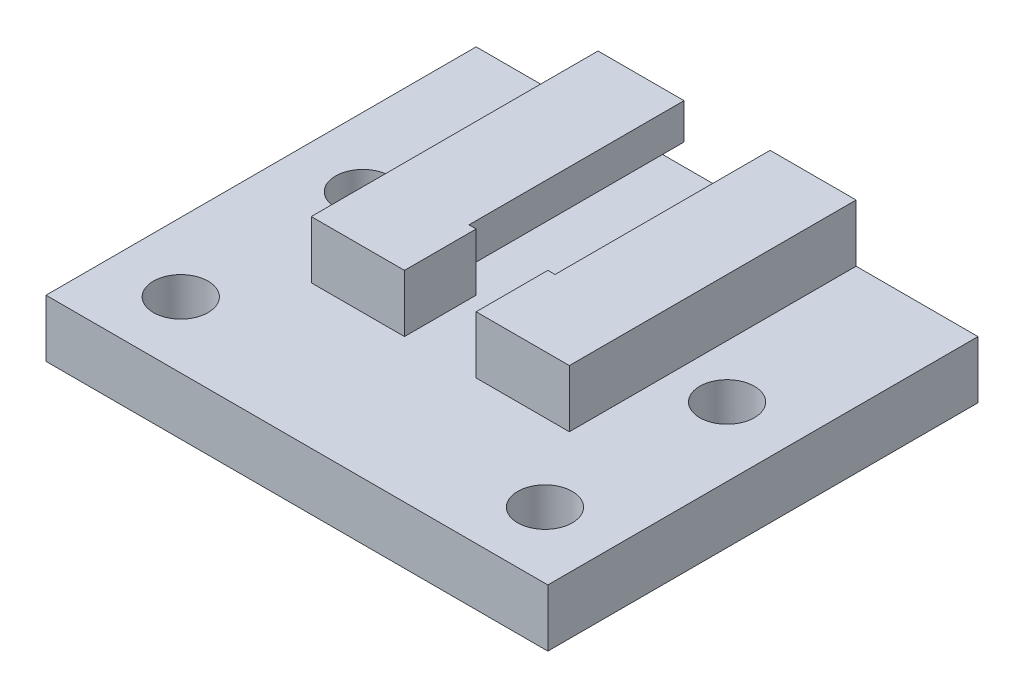
ISO-10303-21;
HEADER;
FILE_DESCRIPTION(('STEP AP214'),'2;1');
FILE_NAME('part.step','',(''),(''),'','','');
FILE_SCHEMA(('AUTOMOTIVE_DESIGN { 1 0 10303 214 1 1 1 1 }'));
ENDSEC;
DATA;
#1=APPLICATION_CONTEXT('core data for automotive mechanical design processes');
#2=APPLICATION_PROTOCOL_DEFINITION('international standard','automotive_design',2000,#1);
#3=PRODUCT_CONTEXT('',#1,'mechanical');
#4=PRODUCT('Part','Part','',(#3));
#5=PRODUCT_RELATED_PRODUCT_CATEGORY('part','',(#4));
#6=PRODUCT_DEFINITION_FORMATION('','',#4);
#7=PRODUCT_DEFINITION_CONTEXT('part definition',#1,'design');
#8=PRODUCT_DEFINITION('design','',#6,#7);
#9=PRODUCT_DEFINITION_SHAPE('','',#8);
#10=(LENGTH_UNIT() NAMED_UNIT(*) SI_UNIT(.MILLI.,.METRE.));
#11=(NAMED_UNIT(*) PLANE_ANGLE_UNIT() SI_UNIT($,.RADIAN.));
#12=(NAMED_UNIT(*) SI_UNIT($,.STERADIAN.) SOLID_ANGLE_UNIT());
#13=UNCERTAINTY_MEASURE_WITH_UNIT(LENGTH_MEASURE(1.E-05),#10,'distance_accuracy_value','');
#14=(GEOMETRIC_REPRESENTATION_CONTEXT(3) GLOBAL_UNCERTAINTY_ASSIGNED_CONTEXT((#13)) GLOBAL_UNIT_ASSIGNED_CONTEXT((#10,
#11,#12)) REPRESENTATION_CONTEXT('',''));
#15=CARTESIAN_POINT('',(0.,0.,0.));
#16=DIRECTION('',(0.,0.,1.));
#17=DIRECTION('',(1.,0.,0.));
#18=AXIS2_PLACEMENT_3D('',#15,#16,#17);
#19=CARTESIAN_POINT('',(0.,0.,5.));
#20=DIRECTION('',(0.,0.,1.));
#21=DIRECTION('',(1.,0.,0.));
#22=AXIS2_PLACEMENT_3D('',#19,#20,#21);
#23=PLANE('',#22);
#24=DIRECTION('',(-1.,0.,0.));
#25=VECTOR('',#24,1.);
#26=CARTESIAN_POINT('',(0.,4.,5.));
#27=LINE('',#26,#25);
#28=CARTESIAN_POINT('',(18.,4.,5.));
#29=VERTEX_POINT('',#28);
#30=CARTESIAN_POINT('',(11.5,4.,5.));
#31=VERTEX_POINT('',#30);
#32=EDGE_CURVE('E251',#29,#31,#27,.T.);
#33=ORIENTED_EDGE('',*,*,#32,.F.);
#34=DIRECTION('',(0.,1.,0.));
#35=VECTOR('',#34,1.);
#36=CARTESIAN_POINT('',(18.,0.,5.));
#37=LINE('',#36,#35);
#38=CARTESIAN_POINT('',(18.,8.,5.));
#39=VERTEX_POINT('',#38);
#40=EDGE_CURVE('E290',#29,#39,#37,.T.);
#41=ORIENTED_EDGE('',*,*,#40,.T.);
#42=DIRECTION('',(-1.,0.,0.));
#43=VECTOR('',#42,1.);
#44=CARTESIAN_POINT('',(0.,8.,5.));
#45=LINE('',#44,#43);
#46=CARTESIAN_POINT('',(11.5,8.,5.));
#47=VERTEX_POINT('',#46);
#48=EDGE_CURVE('E293',#39,#47,#45,.T.);
#49=ORIENTED_EDGE('',*,*,#48,.T.);
#50=DIRECTION('',(0.,-1.,0.));
#51=VECTOR('',#50,1.);
#52=CARTESIAN_POINT('',(11.5,0.,5.));
#53=LINE('',#52,#51);
#54=EDGE_CURVE('E273',#47,#31,#53,.T.);
#55=ORIENTED_EDGE('',*,*,#54,.T.);
#56=EDGE_LOOP('',(#33,#41,#49,#55));
#57=FACE_BOUND('',#56,.T.);
#58=ADVANCED_FACE('F45',(#57),#23,.T.);
#59=CARTESIAN_POINT('',(0.,8.,-15.));
#60=DIRECTION('',(0.,0.,1.));
#61=DIRECTION('',(1.,0.,0.));
#62=AXIS2_PLACEMENT_3D('',#59,#60,#61);
#63=PLANE('',#62);
#64=DIRECTION('',(0.,-1.,0.));
#65=VECTOR('',#64,1.);
#66=CARTESIAN_POINT('',(4.,0.,-15.));
#67=LINE('',#66,#65);
#68=CARTESIAN_POINT('',(4.,5.5,-15.));
#69=VERTEX_POINT('',#68);
#70=CARTESIAN_POINT('',(4.,4.,-15.));
#71=VERTEX_POINT('',#70);
#72=EDGE_CURVE('E324',#69,#71,#67,.T.);
#73=ORIENTED_EDGE('',*,*,#72,.T.);
#74=DIRECTION('',(1.,0.,0.));
#75=VECTOR('',#74,1.);
#76=CARTESIAN_POINT('',(-8.5,4.,-15.));
#77=LINE('',#76,#75);
#78=CARTESIAN_POINT('',(14.,4.,-15.));
#79=VERTEX_POINT('',#78);
#80=EDGE_CURVE('E211',#71,#79,#77,.T.);
#81=ORIENTED_EDGE('',*,*,#80,.T.);
#82=DIRECTION('',(0.,-1.,0.));
#83=VECTOR('',#82,1.);
#84=CARTESIAN_POINT('',(14.,0.,-15.));
#85=LINE('',#84,#83);
#86=CARTESIAN_POINT('',(14.,5.5,-15.));
#87=VERTEX_POINT('',#86);
#88=EDGE_CURVE('E328',#87,#79,#85,.T.);
#89=ORIENTED_EDGE('',*,*,#88,.F.);
#90=DIRECTION('',(1.,0.,0.));
#91=VECTOR('',#90,1.);
#92=CARTESIAN_POINT('',(0.,5.5,-15.));
#93=LINE('',#92,#91);
#94=CARTESIAN_POINT('',(12.,5.5,-15.));
#95=VERTEX_POINT('',#94);
#96=EDGE_CURVE('E325',#95,#87,#93,.T.);
#97=ORIENTED_EDGE('',*,*,#96,.F.);
#98=DIRECTION('',(0.,-1.,0.));
#99=VECTOR('',#98,1.);
#100=CARTESIAN_POINT('',(12.,0.,-15.));
#101=LINE('',#100,#99);
#102=CARTESIAN_POINT('',(12.,8.,-15.));
#103=VERTEX_POINT('',#102);
#104=EDGE_CURVE('E316',#103,#95,#101,.T.);
#105=ORIENTED_EDGE('',*,*,#104,.F.);
#106=DIRECTION('',(-1.,0.,0.));
#107=VECTOR('',#106,1.);
#108=CARTESIAN_POINT('',(0.,8.,-15.));
#109=LINE('',#108,#107);
#110=CARTESIAN_POINT('',(18.,8.,-15.));
#111=VERTEX_POINT('',#110);
#112=EDGE_CURVE('E382',#111,#103,#109,.T.);
#113=ORIENTED_EDGE('',*,*,#112,.F.);
#114=DIRECTION('',(0.,-1.,0.));
#115=VECTOR('',#114,1.);
#116=CARTESIAN_POINT('',(18.,8.,-15.));
#117=LINE('',#116,#115);
#118=CARTESIAN_POINT('',(18.,4.,-15.));
#119=VERTEX_POINT('',#118);
#120=EDGE_CURVE('E55',#111,#119,#117,.T.);
#121=ORIENTED_EDGE('',*,*,#120,.T.);
#122=CARTESIAN_POINT('',(26.5,4.,-15.));
#123=VERTEX_POINT('',#122);
#124=EDGE_CURVE('E213',#119,#123,#77,.T.);
#125=ORIENTED_EDGE('',*,*,#124,.T.);
#126=DIRECTION('',(0.,-1.,0.));
#127=VECTOR('',#126,1.);
#128=CARTESIAN_POINT('',(26.5,4.,-15.));
#129=LINE('',#128,#127);
#130=CARTESIAN_POINT('',(26.5,0.,-15.));
#131=VERTEX_POINT('',#130);
#132=EDGE_CURVE('E199',#123,#131,#129,.T.);
#133=ORIENTED_EDGE('',*,*,#132,.T.);
#134=DIRECTION('',(-1.,0.,0.));
#135=VECTOR('',#134,1.);
#136=CARTESIAN_POINT('',(0.,0.,-15.));
#137=LINE('',#136,#135);
#138=CARTESIAN_POINT('',(-8.5,0.,-15.));
#139=VERTEX_POINT('',#138);
#140=EDGE_CURVE('E193',#131,#139,#137,.T.);
#141=ORIENTED_EDGE('',*,*,#140,.T.);
#142=DIRECTION('',(0.,-1.,0.));
#143=VECTOR('',#142,1.);
#144=CARTESIAN_POINT('',(-8.5,4.,-15.));
#145=LINE('',#144,#143);
#146=CARTESIAN_POINT('',(-8.5,4.,-15.));
#147=VERTEX_POINT('',#146);
#148=EDGE_CURVE('E185',#147,#139,#145,.T.);
#149=ORIENTED_EDGE('',*,*,#148,.F.);
#150=CARTESIAN_POINT('',(0.,4.,-15.));
#151=VERTEX_POINT('',#150);
#152=EDGE_CURVE('E190',#147,#151,#77,.T.);
#153=ORIENTED_EDGE('',*,*,#152,.T.);
#154=DIRECTION('',(0.,-1.,0.));
#155=VECTOR('',#154,1.);
#156=CARTESIAN_POINT('',(0.,8.,-15.));
#157=LINE('',#156,#155);
#158=CARTESIAN_POINT('',(0.,8.,-15.));
#159=VERTEX_POINT('',#158);
#160=EDGE_CURVE('E386',#159,#151,#157,.T.);
#161=ORIENTED_EDGE('',*,*,#160,.F.);
#162=CARTESIAN_POINT('',(6.,8.,-15.));
#163=VERTEX_POINT('',#162);
#164=EDGE_CURVE('E381',#163,#159,#109,.T.);
#165=ORIENTED_EDGE('',*,*,#164,.F.);
#166=DIRECTION('',(0.,-1.,0.));
#167=VECTOR('',#166,1.);
#168=CARTESIAN_POINT('',(6.,0.,-15.));
#169=LINE('',#168,#167);
#170=CARTESIAN_POINT('',(6.,5.5,-15.));
#171=VERTEX_POINT('',#170);
#172=EDGE_CURVE('E70',#163,#171,#169,.T.);
#173=ORIENTED_EDGE('',*,*,#172,.T.);
#174=EDGE_CURVE('E321',#69,#171,#93,.T.);
#175=ORIENTED_EDGE('',*,*,#174,.F.);
#176=EDGE_LOOP('',(#73,#81,#89,#97,#105,#113,#121,#125,#133,#141,#149,#153,#161,#165,#173,#175));
#177=FACE_BOUND('',#176,.T.);
#178=ADVANCED_FACE('F188',(#177),#63,.F.);
#179=CARTESIAN_POINT('',(0.,8.,0.));
#180=DIRECTION('',(0.,-1.,0.));
#181=DIRECTION('',(0.,0.,-1.));
#182=AXIS2_PLACEMENT_3D('',#179,#180,#181);
#183=PLANE('',#182);
#184=DIRECTION('',(0.,0.,1.));
#185=VECTOR('',#184,1.);
#186=CARTESIAN_POINT('',(12.,8.,-15.));
#187=LINE('',#186,#185);
#188=CARTESIAN_POINT('',(12.,8.,0.));
#189=VERTEX_POINT('',#188);
#190=EDGE_CURVE('E352',#103,#189,#187,.T.);
#191=ORIENTED_EDGE('',*,*,#190,.T.);
#192=DIRECTION('',(-1.,0.,0.));
#193=VECTOR('',#192,1.);
#194=CARTESIAN_POINT('',(0.,8.,0.));
#195=LINE('',#194,#193);
#196=CARTESIAN_POINT('',(11.5,8.,0.));
#197=VERTEX_POINT('',#196);
#198=EDGE_CURVE('E278',#189,#197,#195,.T.);
#199=ORIENTED_EDGE('',*,*,#198,.T.);
#200=DIRECTION('',(0.,0.,-1.));
#201=VECTOR('',#200,1.);
#202=CARTESIAN_POINT('',(11.5,8.,5.));
#203=LINE('',#202,#201);
#204=EDGE_CURVE('E296',#47,#197,#203,.T.);
#205=ORIENTED_EDGE('',*,*,#204,.F.);
#206=ORIENTED_EDGE('',*,*,#48,.F.);
#207=DIRECTION('',(0.,0.,-1.));
#208=VECTOR('',#207,1.);
#209=CARTESIAN_POINT('',(18.,8.,0.));
#210=LINE('',#209,#208);
#211=EDGE_CURVE('E378',#39,#111,#210,.T.);
#212=ORIENTED_EDGE('',*,*,#211,.T.);
#213=ORIENTED_EDGE('',*,*,#112,.T.);
#214=EDGE_LOOP('',(#191,#199,#205,#206,#212,#213));
#215=FACE_BOUND('',#214,.T.);
#216=ADVANCED_FACE('F473',(#215),#183,.F.);
#217=CARTESIAN_POINT('',(0.,8.,0.));
#218=DIRECTION('',(1.,0.,0.));
#219=DIRECTION('',(0.,0.,-1.));
#220=AXIS2_PLACEMENT_3D('',#217,#218,#219);
#221=PLANE('',#220);
#222=ORIENTED_EDGE('',*,*,#160,.T.);
#223=DIRECTION('',(0.,0.,1.));
#224=VECTOR('',#223,1.);
#225=CARTESIAN_POINT('',(0.,4.,0.));
#226=LINE('',#225,#224);
#227=CARTESIAN_POINT('',(0.,4.,5.));
#228=VERTEX_POINT('',#227);
#229=EDGE_CURVE('E208',#151,#228,#226,.T.);
#230=ORIENTED_EDGE('',*,*,#229,.T.);
#231=DIRECTION('',(0.,-1.,0.));
#232=VECTOR('',#231,1.);
#233=CARTESIAN_POINT('',(0.,0.,5.));
#234=LINE('',#233,#232);
#235=CARTESIAN_POINT('',(0.,8.,5.));
#236=VERTEX_POINT('',#235);
#237=EDGE_CURVE('E286',#236,#228,#234,.T.);
#238=ORIENTED_EDGE('',*,*,#237,.F.);
#239=DIRECTION('',(0.,0.,1.));
#240=VECTOR('',#239,1.);
#241=CARTESIAN_POINT('',(0.,8.,0.));
#242=LINE('',#241,#240);
#243=EDGE_CURVE('E375',#159,#236,#242,.T.);
#244=ORIENTED_EDGE('',*,*,#243,.F.);
#245=EDGE_LOOP('',(#222,#230,#238,#244));
#246=FACE_BOUND('',#245,.T.);
#247=ADVANCED_FACE('F47',(#246),#221,.F.);
#248=CARTESIAN_POINT('',(18.,8.,0.));
#249=DIRECTION('',(-1.,0.,0.));
#250=DIRECTION('',(0.,0.,1.));
#251=AXIS2_PLACEMENT_3D('',#248,#249,#250);
#252=PLANE('',#251);
#253=ORIENTED_EDGE('',*,*,#40,.F.);
#254=DIRECTION('',(0.,0.,-1.));
#255=VECTOR('',#254,1.);
#256=CARTESIAN_POINT('',(18.,4.,0.));
#257=LINE('',#256,#255);
#258=EDGE_CURVE('E254',#29,#119,#257,.T.);
#259=ORIENTED_EDGE('',*,*,#258,.T.);
#260=ORIENTED_EDGE('',*,*,#120,.F.);
#261=ORIENTED_EDGE('',*,*,#211,.F.);
#262=EDGE_LOOP('',(#253,#259,#260,#261));
#263=FACE_BOUND('',#262,.T.);
#264=ADVANCED_FACE('F467',(#263),#252,.F.);
#265=ORIENTED_EDGE('',*,*,#243,.T.);
#266=DIRECTION('',(-1.,0.,0.));
#267=VECTOR('',#266,1.);
#268=CARTESIAN_POINT('',(0.,8.,5.));
#269=LINE('',#268,#267);
#270=CARTESIAN_POINT('',(6.5,8.,5.));
#271=VERTEX_POINT('',#270);
#272=EDGE_CURVE('E282',#271,#236,#269,.T.);
#273=ORIENTED_EDGE('',*,*,#272,.F.);
#274=DIRECTION('',(0.,0.,-1.));
#275=VECTOR('',#274,1.);
#276=CARTESIAN_POINT('',(6.5,8.,5.));
#277=LINE('',#276,#275);
#278=CARTESIAN_POINT('',(6.5,8.,0.));
#279=VERTEX_POINT('',#278);
#280=EDGE_CURVE('E313',#271,#279,#277,.T.);
#281=ORIENTED_EDGE('',*,*,#280,.T.);
#282=DIRECTION('',(-1.,0.,0.));
#283=VECTOR('',#282,1.);
#284=CARTESIAN_POINT('',(0.,8.,0.));
#285=LINE('',#284,#283);
#286=CARTESIAN_POINT('',(6.,8.,0.));
#287=VERTEX_POINT('',#286);
#288=EDGE_CURVE('E304',#279,#287,#285,.T.);
#289=ORIENTED_EDGE('',*,*,#288,.T.);
#290=DIRECTION('',(0.,0.,1.));
#291=VECTOR('',#290,1.);
#292=CARTESIAN_POINT('',(6.,8.,-15.));
#293=LINE('',#292,#291);
#294=EDGE_CURVE('E349',#163,#287,#293,.T.);
#295=ORIENTED_EDGE('',*,*,#294,.F.);
#296=ORIENTED_EDGE('',*,*,#164,.T.);
#297=EDGE_LOOP('',(#265,#273,#281,#289,#295,#296));
#298=FACE_BOUND('',#297,.T.);
#299=ADVANCED_FACE('F451',(#298),#183,.F.);
#300=CARTESIAN_POINT('',(0.,0.,0.));
#301=DIRECTION('',(0.,-1.,0.));
#302=DIRECTION('',(0.,0.,-1.));
#303=AXIS2_PLACEMENT_3D('',#300,#301,#302);
#304=PLANE('',#303);
#305=CARTESIAN_POINT('',(21.7,0.,-2.29999999999999));
#306=DIRECTION('',(0.,-1.,0.));
#307=DIRECTION('',(0.,0.,-1.));
#308=AXIS2_PLACEMENT_3D('',#305,#306,#307);
#309=CIRCLE('',#308,1.905);
#310=CARTESIAN_POINT('',(21.7,0.,-4.20499999999999));
#311=VERTEX_POINT('',#310);
#312=EDGE_CURVE('E441',#311,#311,#309,.T.);
#313=ORIENTED_EDGE('',*,*,#312,.F.);
#314=EDGE_LOOP('',(#313));
#315=FACE_BOUND('',#314,.T.);
#316=CARTESIAN_POINT('',(-3.7,0.,10.4));
#317=DIRECTION('',(0.,-1.,0.));
#318=DIRECTION('',(0.,0.,-1.));
#319=AXIS2_PLACEMENT_3D('',#316,#317,#318);
#320=CIRCLE('',#319,1.905);
#321=CARTESIAN_POINT('',(-3.7,0.,8.49500000000001));
#322=VERTEX_POINT('',#321);
#323=EDGE_CURVE('E435',#322,#322,#320,.T.);
#324=ORIENTED_EDGE('',*,*,#323,.F.);
#325=EDGE_LOOP('',(#324));
#326=FACE_BOUND('',#325,.T.);
#327=CARTESIAN_POINT('',(21.7,0.,10.4));
#328=DIRECTION('',(0.,-1.,0.));
#329=DIRECTION('',(0.,0.,-1.));
#330=AXIS2_PLACEMENT_3D('',#327,#328,#329);
#331=CIRCLE('',#330,1.905);
#332=CARTESIAN_POINT('',(21.7,0.,8.49500000000001));
#333=VERTEX_POINT('',#332);
#334=EDGE_CURVE('E432',#333,#333,#331,.T.);
#335=ORIENTED_EDGE('',*,*,#334,.F.);
#336=EDGE_LOOP('',(#335));
#337=FACE_BOUND('',#336,.T.);
#338=CARTESIAN_POINT('',(-3.7,0.,-2.29999999999999));
#339=DIRECTION('',(0.,-1.,0.));
#340=DIRECTION('',(0.,0.,-1.));
#341=AXIS2_PLACEMENT_3D('',#338,#339,#340);
#342=CIRCLE('',#341,1.905);
#343=CARTESIAN_POINT('',(-3.7,0.,-4.20499999999999));
#344=VERTEX_POINT('',#343);
#345=EDGE_CURVE('E225',#344,#344,#342,.T.);
#346=ORIENTED_EDGE('',*,*,#345,.F.);
#347=EDGE_LOOP('',(#346));
#348=FACE_BOUND('',#347,.T.);
#349=ORIENTED_EDGE('',*,*,#140,.F.);
#350=DIRECTION('',(0.,0.,1.));
#351=VECTOR('',#350,1.);
#352=CARTESIAN_POINT('',(26.5,0.,-15.));
#353=LINE('',#352,#351);
#354=CARTESIAN_POINT('',(26.5,0.,15.));
#355=VERTEX_POINT('',#354);
#356=EDGE_CURVE('E222',#131,#355,#353,.T.);
#357=ORIENTED_EDGE('',*,*,#356,.T.);
#358=DIRECTION('',(-1.,0.,0.));
#359=VECTOR('',#358,1.);
#360=CARTESIAN_POINT('',(-8.5,0.,15.));
#361=LINE('',#360,#359);
#362=CARTESIAN_POINT('',(-8.5,0.,15.));
#363=VERTEX_POINT('',#362);
#364=EDGE_CURVE('E217',#355,#363,#361,.T.);
#365=ORIENTED_EDGE('',*,*,#364,.T.);
#366=DIRECTION('',(0.,0.,-1.));
#367=VECTOR('',#366,1.);
#368=CARTESIAN_POINT('',(-8.5,0.,-15.));
#369=LINE('',#368,#367);
#370=EDGE_CURVE('E233',#363,#139,#369,.T.);
#371=ORIENTED_EDGE('',*,*,#370,.T.);
#372=EDGE_LOOP('',(#349,#357,#365,#371));
#373=FACE_BOUND('',#372,.T.);
#374=ADVANCED_FACE('F447',(#315,#326,#337,#348,#373),#304,.T.);
#375=CARTESIAN_POINT('',(0.,5.5,-15.));
#376=DIRECTION('',(0.,-1.,0.));
#377=DIRECTION('',(0.,0.,-1.));
#378=AXIS2_PLACEMENT_3D('',#375,#376,#377);
#379=PLANE('',#378);
#380=DIRECTION('',(-1.,0.,0.));
#381=VECTOR('',#380,1.);
#382=CARTESIAN_POINT('',(0.,5.5,0.));
#383=LINE('',#382,#381);
#384=CARTESIAN_POINT('',(14.,5.5,0.));
#385=VERTEX_POINT('',#384);
#386=CARTESIAN_POINT('',(12.,5.5,0.));
#387=VERTEX_POINT('',#386);
#388=EDGE_CURVE('E372',#385,#387,#383,.T.);
#389=ORIENTED_EDGE('',*,*,#388,.T.);
#390=DIRECTION('',(0.,0.,1.));
#391=VECTOR('',#390,1.);
#392=CARTESIAN_POINT('',(12.,5.5,-15.));
#393=LINE('',#392,#391);
#394=EDGE_CURVE('E332',#95,#387,#393,.T.);
#395=ORIENTED_EDGE('',*,*,#394,.F.);
#396=ORIENTED_EDGE('',*,*,#96,.T.);
#397=DIRECTION('',(0.,0.,1.));
#398=VECTOR('',#397,1.);
#399=CARTESIAN_POINT('',(14.,5.5,-15.));
#400=LINE('',#399,#398);
#401=EDGE_CURVE('E337',#87,#385,#400,.T.);
#402=ORIENTED_EDGE('',*,*,#401,.T.);
#403=EDGE_LOOP('',(#389,#395,#396,#402));
#404=FACE_BOUND('',#403,.T.);
#405=ADVANCED_FACE('F450',(#404),#379,.T.);
#406=CARTESIAN_POINT('',(14.,0.,-15.));
#407=DIRECTION('',(-1.,0.,0.));
#408=DIRECTION('',(0.,0.,1.));
#409=AXIS2_PLACEMENT_3D('',#406,#407,#408);
#410=PLANE('',#409);
#411=DIRECTION('',(0.,0.,-1.));
#412=VECTOR('',#411,1.);
#413=CARTESIAN_POINT('',(14.,4.,-15.));
#414=LINE('',#413,#412);
#415=CARTESIAN_POINT('',(14.,4.,0.));
#416=VERTEX_POINT('',#415);
#417=EDGE_CURVE('E248',#416,#79,#414,.T.);
#418=ORIENTED_EDGE('',*,*,#417,.F.);
#419=DIRECTION('',(0.,1.,0.));
#420=VECTOR('',#419,1.);
#421=CARTESIAN_POINT('',(14.,8.,0.));
#422=LINE('',#421,#420);
#423=EDGE_CURVE('E369',#416,#385,#422,.T.);
#424=ORIENTED_EDGE('',*,*,#423,.T.);
#425=ORIENTED_EDGE('',*,*,#401,.F.);
#426=ORIENTED_EDGE('',*,*,#88,.T.);
#427=EDGE_LOOP('',(#418,#424,#425,#426));
#428=FACE_BOUND('',#427,.T.);
#429=ADVANCED_FACE('F489',(#428),#410,.T.);
#430=CARTESIAN_POINT('',(4.,0.,-15.));
#431=DIRECTION('',(-1.,0.,0.));
#432=DIRECTION('',(0.,0.,1.));
#433=AXIS2_PLACEMENT_3D('',#430,#431,#432);
#434=PLANE('',#433);
#435=DIRECTION('',(0.,1.,0.));
#436=VECTOR('',#435,1.);
#437=CARTESIAN_POINT('',(4.,8.,0.));
#438=LINE('',#437,#436);
#439=CARTESIAN_POINT('',(4.,4.,0.));
#440=VERTEX_POINT('',#439);
#441=CARTESIAN_POINT('',(4.,5.5,0.));
#442=VERTEX_POINT('',#441);
#443=EDGE_CURVE('E366',#440,#442,#438,.T.);
#444=ORIENTED_EDGE('',*,*,#443,.F.);
#445=DIRECTION('',(0.,0.,-1.));
#446=VECTOR('',#445,1.);
#447=CARTESIAN_POINT('',(4.,4.,-15.));
#448=LINE('',#447,#446);
#449=EDGE_CURVE('E266',#440,#71,#448,.T.);
#450=ORIENTED_EDGE('',*,*,#449,.T.);
#451=ORIENTED_EDGE('',*,*,#72,.F.);
#452=DIRECTION('',(0.,0.,1.));
#453=VECTOR('',#452,1.);
#454=CARTESIAN_POINT('',(4.,5.5,-15.));
#455=LINE('',#454,#453);
#456=EDGE_CURVE('E341',#69,#442,#455,.T.);
#457=ORIENTED_EDGE('',*,*,#456,.T.);
#458=EDGE_LOOP('',(#444,#450,#451,#457));
#459=FACE_BOUND('',#458,.T.);
#460=ADVANCED_FACE('F518',(#459),#434,.F.);
#461=DIRECTION('',(-1.,0.,0.));
#462=VECTOR('',#461,1.);
#463=CARTESIAN_POINT('',(0.,5.5,0.));
#464=LINE('',#463,#462);
#465=CARTESIAN_POINT('',(6.,5.5,0.));
#466=VERTEX_POINT('',#465);
#467=EDGE_CURVE('E362',#466,#442,#464,.T.);
#468=ORIENTED_EDGE('',*,*,#467,.T.);
#469=ORIENTED_EDGE('',*,*,#456,.F.);
#470=ORIENTED_EDGE('',*,*,#174,.T.);
#471=DIRECTION('',(0.,0.,1.));
#472=VECTOR('',#471,1.);
#473=CARTESIAN_POINT('',(6.,5.5,-15.));
#474=LINE('',#473,#472);
#475=EDGE_CURVE('E345',#171,#466,#474,.T.);
#476=ORIENTED_EDGE('',*,*,#475,.T.);
#477=EDGE_LOOP('',(#468,#469,#470,#476));
#478=FACE_BOUND('',#477,.T.);
#479=ADVANCED_FACE('F520',(#478),#379,.T.);
#480=CARTESIAN_POINT('',(12.,0.,-15.));
#481=DIRECTION('',(-1.,0.,0.));
#482=DIRECTION('',(0.,0.,1.));
#483=AXIS2_PLACEMENT_3D('',#480,#481,#482);
#484=PLANE('',#483);
#485=DIRECTION('',(0.,1.,0.));
#486=VECTOR('',#485,1.);
#487=CARTESIAN_POINT('',(12.,8.,0.));
#488=LINE('',#487,#486);
#489=EDGE_CURVE('E359',#387,#189,#488,.T.);
#490=ORIENTED_EDGE('',*,*,#489,.T.);
#491=ORIENTED_EDGE('',*,*,#190,.F.);
#492=ORIENTED_EDGE('',*,*,#104,.T.);
#493=ORIENTED_EDGE('',*,*,#394,.T.);
#494=EDGE_LOOP('',(#490,#491,#492,#493));
#495=FACE_BOUND('',#494,.T.);
#496=ADVANCED_FACE('F523',(#495),#484,.T.);
#497=CARTESIAN_POINT('',(6.,0.,-15.));
#498=DIRECTION('',(-1.,0.,0.));
#499=DIRECTION('',(0.,0.,1.));
#500=AXIS2_PLACEMENT_3D('',#497,#498,#499);
#501=PLANE('',#500);
#502=ORIENTED_EDGE('',*,*,#475,.F.);
#503=ORIENTED_EDGE('',*,*,#172,.F.);
#504=ORIENTED_EDGE('',*,*,#294,.T.);
#505=DIRECTION('',(0.,1.,0.));
#506=VECTOR('',#505,1.);
#507=CARTESIAN_POINT('',(6.,8.,0.));
#508=LINE('',#507,#506);
#509=EDGE_CURVE('E336',#466,#287,#508,.T.);
#510=ORIENTED_EDGE('',*,*,#509,.F.);
#511=EDGE_LOOP('',(#502,#503,#504,#510));
#512=FACE_BOUND('',#511,.T.);
#513=ADVANCED_FACE('F521',(#512),#501,.F.);
#514=CARTESIAN_POINT('',(0.,0.,0.));
#515=DIRECTION('',(0.,0.,1.));
#516=DIRECTION('',(1.,0.,0.));
#517=AXIS2_PLACEMENT_3D('',#514,#515,#516);
#518=PLANE('',#517);
#519=DIRECTION('',(0.,-1.,0.));
#520=VECTOR('',#519,1.);
#521=CARTESIAN_POINT('',(6.5,0.,0.));
#522=LINE('',#521,#520);
#523=CARTESIAN_POINT('',(6.5,4.,0.));
#524=VERTEX_POINT('',#523);
#525=EDGE_CURVE('E300',#279,#524,#522,.T.);
#526=ORIENTED_EDGE('',*,*,#525,.T.);
#527=DIRECTION('',(-1.,0.,0.));
#528=VECTOR('',#527,1.);
#529=CARTESIAN_POINT('',(0.,4.,0.));
#530=LINE('',#529,#528);
#531=EDGE_CURVE('E262',#524,#440,#530,.T.);
#532=ORIENTED_EDGE('',*,*,#531,.T.);
#533=ORIENTED_EDGE('',*,*,#443,.T.);
#534=ORIENTED_EDGE('',*,*,#467,.F.);
#535=ORIENTED_EDGE('',*,*,#509,.T.);
#536=ORIENTED_EDGE('',*,*,#288,.F.);
#537=EDGE_LOOP('',(#526,#532,#533,#534,#535,#536));
#538=FACE_BOUND('',#537,.T.);
#539=ADVANCED_FACE('F512',(#538),#518,.F.);
#540=CARTESIAN_POINT('',(11.5,0.,5.));
#541=DIRECTION('',(1.,0.,0.));
#542=DIRECTION('',(0.,0.,-1.));
#543=AXIS2_PLACEMENT_3D('',#540,#541,#542);
#544=PLANE('',#543);
#545=DIRECTION('',(0.,-1.,0.));
#546=VECTOR('',#545,1.);
#547=CARTESIAN_POINT('',(11.5,0.,0.));
#548=LINE('',#547,#546);
#549=CARTESIAN_POINT('',(11.5,4.,0.));
#550=VERTEX_POINT('',#549);
#551=EDGE_CURVE('E272',#197,#550,#548,.T.);
#552=ORIENTED_EDGE('',*,*,#551,.T.);
#553=DIRECTION('',(0.,0.,1.));
#554=VECTOR('',#553,1.);
#555=CARTESIAN_POINT('',(11.5,4.,5.));
#556=LINE('',#555,#554);
#557=EDGE_CURVE('E63',#550,#31,#556,.T.);
#558=ORIENTED_EDGE('',*,*,#557,.T.);
#559=ORIENTED_EDGE('',*,*,#54,.F.);
#560=ORIENTED_EDGE('',*,*,#204,.T.);
#561=EDGE_LOOP('',(#552,#558,#559,#560));
#562=FACE_BOUND('',#561,.T.);
#563=ADVANCED_FACE('F480',(#562),#544,.F.);
#564=CARTESIAN_POINT('',(6.5,0.,5.));
#565=DIRECTION('',(1.,0.,0.));
#566=DIRECTION('',(0.,0.,-1.));
#567=AXIS2_PLACEMENT_3D('',#564,#565,#566);
#568=PLANE('',#567);
#569=DIRECTION('',(0.,0.,1.));
#570=VECTOR('',#569,1.);
#571=CARTESIAN_POINT('',(6.5,4.,5.));
#572=LINE('',#571,#570);
#573=CARTESIAN_POINT('',(6.5,4.,5.));
#574=VERTEX_POINT('',#573);
#575=EDGE_CURVE('E259',#524,#574,#572,.T.);
#576=ORIENTED_EDGE('',*,*,#575,.F.);
#577=ORIENTED_EDGE('',*,*,#525,.F.);
#578=ORIENTED_EDGE('',*,*,#280,.F.);
#579=DIRECTION('',(0.,-1.,0.));
#580=VECTOR('',#579,1.);
#581=CARTESIAN_POINT('',(6.5,0.,5.));
#582=LINE('',#581,#580);
#583=EDGE_CURVE('E277',#271,#574,#582,.T.);
#584=ORIENTED_EDGE('',*,*,#583,.T.);
#585=EDGE_LOOP('',(#576,#577,#578,#584));
#586=FACE_BOUND('',#585,.T.);
#587=ADVANCED_FACE('F515',(#586),#568,.T.);
#588=EDGE_CURVE('E255',#574,#228,#27,.T.);
#589=ORIENTED_EDGE('',*,*,#588,.F.);
#590=ORIENTED_EDGE('',*,*,#583,.F.);
#591=ORIENTED_EDGE('',*,*,#272,.T.);
#592=ORIENTED_EDGE('',*,*,#237,.T.);
#593=EDGE_LOOP('',(#589,#590,#591,#592));
#594=FACE_BOUND('',#593,.T.);
#595=ADVANCED_FACE('F506',(#594),#23,.T.);
#596=ORIENTED_EDGE('',*,*,#423,.F.);
#597=DIRECTION('',(-1.,0.,0.));
#598=VECTOR('',#597,1.);
#599=CARTESIAN_POINT('',(0.,4.,0.));
#600=LINE('',#599,#598);
#601=EDGE_CURVE('E11',#416,#550,#600,.T.);
#602=ORIENTED_EDGE('',*,*,#601,.T.);
#603=ORIENTED_EDGE('',*,*,#551,.F.);
#604=ORIENTED_EDGE('',*,*,#198,.F.);
#605=ORIENTED_EDGE('',*,*,#489,.F.);
#606=ORIENTED_EDGE('',*,*,#388,.F.);
#607=EDGE_LOOP('',(#596,#602,#603,#604,#605,#606));
#608=FACE_BOUND('',#607,.T.);
#609=ADVANCED_FACE('F415',(#608),#518,.F.);
#610=CARTESIAN_POINT('',(0.,4.,0.));
#611=DIRECTION('',(0.,1.,0.));
#612=DIRECTION('',(0.,0.,1.));
#613=AXIS2_PLACEMENT_3D('',#610,#611,#612);
#614=PLANE('',#613);
#615=CARTESIAN_POINT('',(21.7,4.,-2.29999999999999));
#616=DIRECTION('',(0.,1.,0.));
#617=DIRECTION('',(0.,0.,1.));
#618=AXIS2_PLACEMENT_3D('',#615,#616,#617);
#619=CIRCLE('',#618,1.905);
#620=CARTESIAN_POINT('',(21.7,4.,-0.394999999999993));
#621=VERTEX_POINT('',#620);
#622=EDGE_CURVE('E49',#621,#621,#619,.T.);
#623=ORIENTED_EDGE('',*,*,#622,.F.);
#624=EDGE_LOOP('',(#623));
#625=FACE_BOUND('',#624,.T.);
#626=CARTESIAN_POINT('',(-3.7,4.,10.4));
#627=DIRECTION('',(0.,1.,0.));
#628=DIRECTION('',(0.,0.,1.));
#629=AXIS2_PLACEMENT_3D('',#626,#627,#628);
#630=CIRCLE('',#629,1.905);
#631=CARTESIAN_POINT('',(-3.7,4.,12.305));
#632=VERTEX_POINT('',#631);
#633=EDGE_CURVE('E401',#632,#632,#630,.T.);
#634=ORIENTED_EDGE('',*,*,#633,.F.);
#635=EDGE_LOOP('',(#634));
#636=FACE_BOUND('',#635,.T.);
#637=CARTESIAN_POINT('',(21.7,4.,10.4));
#638=DIRECTION('',(0.,1.,0.));
#639=DIRECTION('',(0.,0.,1.));
#640=AXIS2_PLACEMENT_3D('',#637,#638,#639);
#641=CIRCLE('',#640,1.905);
#642=CARTESIAN_POINT('',(21.7,4.,12.305));
#643=VERTEX_POINT('',#642);
#644=EDGE_CURVE('E398',#643,#643,#641,.T.);
#645=ORIENTED_EDGE('',*,*,#644,.F.);
#646=EDGE_LOOP('',(#645));
#647=FACE_BOUND('',#646,.T.);
#648=CARTESIAN_POINT('',(-3.7,4.,-2.29999999999999));
#649=DIRECTION('',(0.,1.,0.));
#650=DIRECTION('',(0.,0.,1.));
#651=AXIS2_PLACEMENT_3D('',#648,#649,#650);
#652=CIRCLE('',#651,1.905);
#653=CARTESIAN_POINT('',(-3.7,4.,-0.394999999999993));
#654=VERTEX_POINT('',#653);
#655=EDGE_CURVE('E394',#654,#654,#652,.T.);
#656=ORIENTED_EDGE('',*,*,#655,.F.);
#657=EDGE_LOOP('',(#656));
#658=FACE_BOUND('',#657,.T.);
#659=ORIENTED_EDGE('',*,*,#229,.F.);
#660=ORIENTED_EDGE('',*,*,#152,.F.);
#661=DIRECTION('',(0.,0.,-1.));
#662=VECTOR('',#661,1.);
#663=CARTESIAN_POINT('',(-8.5,4.,-15.));
#664=LINE('',#663,#662);
#665=CARTESIAN_POINT('',(-8.5,4.,15.));
#666=VERTEX_POINT('',#665);
#667=EDGE_CURVE('E205',#666,#147,#664,.T.);
#668=ORIENTED_EDGE('',*,*,#667,.F.);
#669=DIRECTION('',(-1.,0.,0.));
#670=VECTOR('',#669,1.);
#671=CARTESIAN_POINT('',(-8.5,4.,15.));
#672=LINE('',#671,#670);
#673=CARTESIAN_POINT('',(26.5,4.,15.));
#674=VERTEX_POINT('',#673);
#675=EDGE_CURVE('E200',#674,#666,#672,.T.);
#676=ORIENTED_EDGE('',*,*,#675,.F.);
#677=DIRECTION('',(0.,0.,1.));
#678=VECTOR('',#677,1.);
#679=CARTESIAN_POINT('',(26.5,4.,-15.));
#680=LINE('',#679,#678);
#681=EDGE_CURVE('E210',#123,#674,#680,.T.);
#682=ORIENTED_EDGE('',*,*,#681,.F.);
#683=ORIENTED_EDGE('',*,*,#124,.F.);
#684=ORIENTED_EDGE('',*,*,#258,.F.);
#685=ORIENTED_EDGE('',*,*,#32,.T.);
#686=ORIENTED_EDGE('',*,*,#557,.F.);
#687=ORIENTED_EDGE('',*,*,#601,.F.);
#688=ORIENTED_EDGE('',*,*,#417,.T.);
#689=ORIENTED_EDGE('',*,*,#80,.F.);
#690=ORIENTED_EDGE('',*,*,#449,.F.);
#691=ORIENTED_EDGE('',*,*,#531,.F.);
#692=ORIENTED_EDGE('',*,*,#575,.T.);
#693=ORIENTED_EDGE('',*,*,#588,.T.);
#694=EDGE_LOOP('',(#659,#660,#668,#676,#682,#683,#684,#685,#686,#687,#688,#689,#690,#691,#692,#693));
#695=FACE_BOUND('',#694,.T.);
#696=ADVANCED_FACE('F203',(#625,#636,#647,#658,#695),#614,.T.);
#697=CARTESIAN_POINT('',(-8.5,4.,-15.));
#698=DIRECTION('',(-1.,0.,0.));
#699=DIRECTION('',(0.,0.,1.));
#700=AXIS2_PLACEMENT_3D('',#697,#698,#699);
#701=PLANE('',#700);
#702=ORIENTED_EDGE('',*,*,#370,.F.);
#703=DIRECTION('',(0.,-1.,0.));
#704=VECTOR('',#703,1.);
#705=CARTESIAN_POINT('',(-8.5,4.,15.));
#706=LINE('',#705,#704);
#707=EDGE_CURVE('E215',#666,#363,#706,.T.);
#708=ORIENTED_EDGE('',*,*,#707,.F.);
#709=ORIENTED_EDGE('',*,*,#667,.T.);
#710=ORIENTED_EDGE('',*,*,#148,.T.);
#711=EDGE_LOOP('',(#702,#708,#709,#710));
#712=FACE_BOUND('',#711,.T.);
#713=ADVANCED_FACE('F214',(#712),#701,.T.);
#714=CARTESIAN_POINT('',(-8.5,4.,15.));
#715=DIRECTION('',(0.,0.,1.));
#716=DIRECTION('',(1.,0.,0.));
#717=AXIS2_PLACEMENT_3D('',#714,#715,#716);
#718=PLANE('',#717);
#719=ORIENTED_EDGE('',*,*,#364,.F.);
#720=DIRECTION('',(0.,-1.,0.));
#721=VECTOR('',#720,1.);
#722=CARTESIAN_POINT('',(26.5,4.,15.));
#723=LINE('',#722,#721);
#724=EDGE_CURVE('E241',#674,#355,#723,.T.);
#725=ORIENTED_EDGE('',*,*,#724,.F.);
#726=ORIENTED_EDGE('',*,*,#675,.T.);
#727=ORIENTED_EDGE('',*,*,#707,.T.);
#728=EDGE_LOOP('',(#719,#725,#726,#727));
#729=FACE_BOUND('',#728,.T.);
#730=ADVANCED_FACE('F462',(#729),#718,.T.);
#731=CARTESIAN_POINT('',(26.5,4.,-15.));
#732=DIRECTION('',(1.,0.,0.));
#733=DIRECTION('',(0.,0.,-1.));
#734=AXIS2_PLACEMENT_3D('',#731,#732,#733);
#735=PLANE('',#734);
#736=ORIENTED_EDGE('',*,*,#356,.F.);
#737=ORIENTED_EDGE('',*,*,#132,.F.);
#738=ORIENTED_EDGE('',*,*,#681,.T.);
#739=ORIENTED_EDGE('',*,*,#724,.T.);
#740=EDGE_LOOP('',(#736,#737,#738,#739));
#741=FACE_BOUND('',#740,.T.);
#742=ADVANCED_FACE('F426',(#741),#735,.T.);
#743=CARTESIAN_POINT('',(-3.7,8.,-2.29999999999999));
#744=DIRECTION('',(0.,-1.,0.));
#745=DIRECTION('',(0.,0.,-1.));
#746=AXIS2_PLACEMENT_3D('',#743,#744,#745);
#747=CYLINDRICAL_SURFACE('',#746,1.905);
#748=ORIENTED_EDGE('',*,*,#655,.T.);
#749=EDGE_LOOP('',(#748));
#750=FACE_BOUND('',#749,.T.);
#751=ORIENTED_EDGE('',*,*,#345,.T.);
#752=EDGE_LOOP('',(#751));
#753=FACE_BOUND('',#752,.T.);
#754=ADVANCED_FACE('F422',(#750,#753),#747,.F.);
#755=CARTESIAN_POINT('',(21.7,8.,10.4));
#756=DIRECTION('',(0.,-1.,0.));
#757=DIRECTION('',(0.,0.,-1.));
#758=AXIS2_PLACEMENT_3D('',#755,#756,#757);
#759=CYLINDRICAL_SURFACE('',#758,1.905);
#760=ORIENTED_EDGE('',*,*,#644,.T.);
#761=EDGE_LOOP('',(#760));
#762=FACE_BOUND('',#761,.T.);
#763=ORIENTED_EDGE('',*,*,#334,.T.);
#764=EDGE_LOOP('',(#763));
#765=FACE_BOUND('',#764,.T.);
#766=ADVANCED_FACE('F425',(#762,#765),#759,.F.);
#767=CARTESIAN_POINT('',(-3.7,8.,10.4));
#768=DIRECTION('',(0.,-1.,0.));
#769=DIRECTION('',(0.,0.,-1.));
#770=AXIS2_PLACEMENT_3D('',#767,#768,#769);
#771=CYLINDRICAL_SURFACE('',#770,1.905);
#772=ORIENTED_EDGE('',*,*,#633,.T.);
#773=EDGE_LOOP('',(#772));
#774=FACE_BOUND('',#773,.T.);
#775=ORIENTED_EDGE('',*,*,#323,.T.);
#776=EDGE_LOOP('',(#775));
#777=FACE_BOUND('',#776,.T.);
#778=ADVANCED_FACE('F708',(#774,#777),#771,.F.);
#779=CARTESIAN_POINT('',(21.7,8.,-2.29999999999999));
#780=DIRECTION('',(0.,-1.,0.));
#781=DIRECTION('',(0.,0.,-1.));
#782=AXIS2_PLACEMENT_3D('',#779,#780,#781);
#783=CYLINDRICAL_SURFACE('',#782,1.905);
#784=ORIENTED_EDGE('',*,*,#622,.T.);
#785=EDGE_LOOP('',(#784));
#786=FACE_BOUND('',#785,.T.);
#787=ORIENTED_EDGE('',*,*,#312,.T.);
#788=EDGE_LOOP('',(#787));
#789=FACE_BOUND('',#788,.T.);
#790=ADVANCED_FACE('F410',(#786,#789),#783,.F.);
#791=CLOSED_SHELL('',(#58,#178,#216,#247,#264,#299,#374,#405,#429,#460,#479,#496,#513,#539,#563,
#587,#595,#609,#696,#713,#730,#742,#754,#766,#778,#790));
#792=MANIFOLD_SOLID_BREP('B2',#791);
#793=ADVANCED_BREP_SHAPE_REPRESENTATION('',(#18,#792),#14);
#794=SHAPE_DEFINITION_REPRESENTATION(#9,#793);
ENDSEC;
END-ISO-10303-21;
